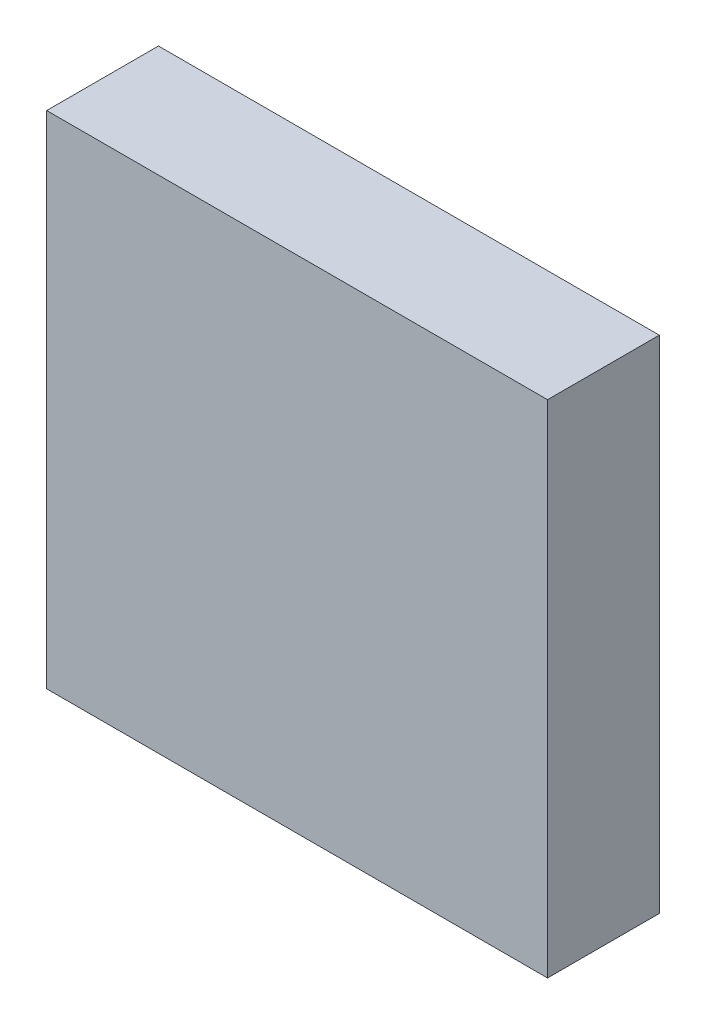
ISO-10303-21;
HEADER;
FILE_DESCRIPTION(('STEP AP214'),'2;1');
FILE_NAME('part.step','',(''),(''),'','','');
FILE_SCHEMA(('AUTOMOTIVE_DESIGN { 1 0 10303 214 1 1 1 1 }'));
ENDSEC;
DATA;
#1=APPLICATION_CONTEXT('core data for automotive mechanical design processes');
#2=APPLICATION_PROTOCOL_DEFINITION('international standard','automotive_design',2000,#1);
#3=PRODUCT_CONTEXT('',#1,'mechanical');
#4=PRODUCT('Part','Part','',(#3));
#5=PRODUCT_RELATED_PRODUCT_CATEGORY('part','',(#4));
#6=PRODUCT_DEFINITION_FORMATION('','',#4);
#7=PRODUCT_DEFINITION_CONTEXT('part definition',#1,'design');
#8=PRODUCT_DEFINITION('design','',#6,#7);
#9=PRODUCT_DEFINITION_SHAPE('','',#8);
#10=(LENGTH_UNIT() NAMED_UNIT(*) SI_UNIT(.MILLI.,.METRE.));
#11=(NAMED_UNIT(*) PLANE_ANGLE_UNIT() SI_UNIT($,.RADIAN.));
#12=(NAMED_UNIT(*) SI_UNIT($,.STERADIAN.) SOLID_ANGLE_UNIT());
#13=UNCERTAINTY_MEASURE_WITH_UNIT(LENGTH_MEASURE(1.E-05),#10,'distance_accuracy_value','');
#14=(GEOMETRIC_REPRESENTATION_CONTEXT(3) GLOBAL_UNCERTAINTY_ASSIGNED_CONTEXT((#13)) GLOBAL_UNIT_ASSIGNED_CONTEXT((#10,
#11,#12)) REPRESENTATION_CONTEXT('',''));
#15=CARTESIAN_POINT('',(0.,0.,0.));
#16=DIRECTION('',(0.,0.,1.));
#17=DIRECTION('',(1.,0.,0.));
#18=AXIS2_PLACEMENT_3D('',#15,#16,#17);
#19=CARTESIAN_POINT('',(-3.58499918,-3.58499918,1.59999934));
#20=DIRECTION('',(0.,0.,1.));
#21=DIRECTION('',(1.,0.,0.));
#22=AXIS2_PLACEMENT_3D('',#19,#20,#21);
#23=PLANE('',#22);
#24=DIRECTION('',(-1.,0.,0.));
#25=VECTOR('',#24,1.);
#26=CARTESIAN_POINT('',(3.58499918,-3.58499918,1.59999934));
#27=LINE('',#26,#25);
#28=CARTESIAN_POINT('',(3.58499918,-3.58499918,1.59999934));
#29=VERTEX_POINT('',#28);
#30=CARTESIAN_POINT('',(-3.58499918,-3.58499918,1.59999934));
#31=VERTEX_POINT('',#30);
#32=EDGE_CURVE('E27',#29,#31,#27,.T.);
#33=ORIENTED_EDGE('',*,*,#32,.F.);
#34=DIRECTION('',(0.,-1.,0.));
#35=VECTOR('',#34,1.);
#36=CARTESIAN_POINT('',(3.58499918,3.58499918,1.59999934));
#37=LINE('',#36,#35);
#38=CARTESIAN_POINT('',(3.58499918,3.58499918,1.59999934));
#39=VERTEX_POINT('',#38);
#40=EDGE_CURVE('E64',#39,#29,#37,.T.);
#41=ORIENTED_EDGE('',*,*,#40,.F.);
#42=DIRECTION('',(1.,0.,0.));
#43=VECTOR('',#42,1.);
#44=CARTESIAN_POINT('',(-3.58499918,3.58499918,1.59999934));
#45=LINE('',#44,#43);
#46=CARTESIAN_POINT('',(-3.58499918,3.58499918,1.59999934));
#47=VERTEX_POINT('',#46);
#48=EDGE_CURVE('E86',#47,#39,#45,.T.);
#49=ORIENTED_EDGE('',*,*,#48,.F.);
#50=DIRECTION('',(0.,1.,0.));
#51=VECTOR('',#50,1.);
#52=CARTESIAN_POINT('',(-3.58499918,-3.58499918,1.59999934));
#53=LINE('',#52,#51);
#54=EDGE_CURVE('E84',#31,#47,#53,.T.);
#55=ORIENTED_EDGE('',*,*,#54,.F.);
#56=EDGE_LOOP('',(#33,#41,#49,#55));
#57=FACE_BOUND('',#56,.T.);
#58=ADVANCED_FACE('F17',(#57),#23,.T.);
#59=CARTESIAN_POINT('',(-3.58499918,-3.58499918,0.));
#60=DIRECTION('',(0.,0.,1.));
#61=DIRECTION('',(1.,0.,0.));
#62=AXIS2_PLACEMENT_3D('',#59,#60,#61);
#63=PLANE('',#62);
#64=DIRECTION('',(0.,1.,0.));
#65=VECTOR('',#64,1.);
#66=CARTESIAN_POINT('',(-3.58499918,-3.58499918,0.));
#67=LINE('',#66,#65);
#68=CARTESIAN_POINT('',(-3.58499918,-3.58499918,0.));
#69=VERTEX_POINT('',#68);
#70=CARTESIAN_POINT('',(-3.58499918,3.58499918,0.));
#71=VERTEX_POINT('',#70);
#72=EDGE_CURVE('E94',#69,#71,#67,.T.);
#73=ORIENTED_EDGE('',*,*,#72,.T.);
#74=DIRECTION('',(1.,0.,0.));
#75=VECTOR('',#74,1.);
#76=CARTESIAN_POINT('',(-3.58499918,3.58499918,0.));
#77=LINE('',#76,#75);
#78=CARTESIAN_POINT('',(3.58499918,3.58499918,0.));
#79=VERTEX_POINT('',#78);
#80=EDGE_CURVE('E112',#71,#79,#77,.T.);
#81=ORIENTED_EDGE('',*,*,#80,.T.);
#82=DIRECTION('',(0.,-1.,0.));
#83=VECTOR('',#82,1.);
#84=CARTESIAN_POINT('',(3.58499918,3.58499918,0.));
#85=LINE('',#84,#83);
#86=CARTESIAN_POINT('',(3.58499918,-3.58499918,0.));
#87=VERTEX_POINT('',#86);
#88=EDGE_CURVE('E52',#79,#87,#85,.T.);
#89=ORIENTED_EDGE('',*,*,#88,.T.);
#90=DIRECTION('',(-1.,0.,0.));
#91=VECTOR('',#90,1.);
#92=CARTESIAN_POINT('',(3.58499918,-3.58499918,0.));
#93=LINE('',#92,#91);
#94=EDGE_CURVE('E11',#87,#69,#93,.T.);
#95=ORIENTED_EDGE('',*,*,#94,.T.);
#96=EDGE_LOOP('',(#73,#81,#89,#95));
#97=FACE_BOUND('',#96,.T.);
#98=ADVANCED_FACE('F171',(#97),#63,.F.);
#99=CARTESIAN_POINT('',(3.58499918,-3.58499918,0.));
#100=DIRECTION('',(0.,-1.,0.));
#101=DIRECTION('',(0.,0.,-1.));
#102=AXIS2_PLACEMENT_3D('',#99,#100,#101);
#103=PLANE('',#102);
#104=DIRECTION('',(0.,0.,1.));
#105=VECTOR('',#104,1.);
#106=CARTESIAN_POINT('',(3.58499918,-3.58499918,0.));
#107=LINE('',#106,#105);
#108=EDGE_CURVE('E20',#87,#29,#107,.T.);
#109=ORIENTED_EDGE('',*,*,#108,.T.);
#110=ORIENTED_EDGE('',*,*,#32,.T.);
#111=DIRECTION('',(0.,0.,1.));
#112=VECTOR('',#111,1.);
#113=CARTESIAN_POINT('',(-3.58499918,-3.58499918,0.));
#114=LINE('',#113,#112);
#115=EDGE_CURVE('E81',#69,#31,#114,.T.);
#116=ORIENTED_EDGE('',*,*,#115,.F.);
#117=ORIENTED_EDGE('',*,*,#94,.F.);
#118=EDGE_LOOP('',(#109,#110,#116,#117));
#119=FACE_BOUND('',#118,.T.);
#120=ADVANCED_FACE('F79',(#119),#103,.T.);
#121=CARTESIAN_POINT('',(3.58499918,3.58499918,0.));
#122=DIRECTION('',(1.,0.,0.));
#123=DIRECTION('',(0.,1.,0.));
#124=AXIS2_PLACEMENT_3D('',#121,#122,#123);
#125=PLANE('',#124);
#126=DIRECTION('',(0.,0.,1.));
#127=VECTOR('',#126,1.);
#128=CARTESIAN_POINT('',(3.58499918,3.58499918,0.));
#129=LINE('',#128,#127);
#130=EDGE_CURVE('E109',#79,#39,#129,.T.);
#131=ORIENTED_EDGE('',*,*,#130,.T.);
#132=ORIENTED_EDGE('',*,*,#40,.T.);
#133=ORIENTED_EDGE('',*,*,#108,.F.);
#134=ORIENTED_EDGE('',*,*,#88,.F.);
#135=EDGE_LOOP('',(#131,#132,#133,#134));
#136=FACE_BOUND('',#135,.T.);
#137=ADVANCED_FACE('F153',(#136),#125,.T.);
#138=CARTESIAN_POINT('',(-3.58499918,3.58499918,0.));
#139=DIRECTION('',(0.,1.,0.));
#140=DIRECTION('',(1.,0.,0.));
#141=AXIS2_PLACEMENT_3D('',#138,#139,#140);
#142=PLANE('',#141);
#143=DIRECTION('',(0.,0.,1.));
#144=VECTOR('',#143,1.);
#145=CARTESIAN_POINT('',(-3.58499918,3.58499918,0.));
#146=LINE('',#145,#144);
#147=EDGE_CURVE('E91',#71,#47,#146,.T.);
#148=ORIENTED_EDGE('',*,*,#147,.T.);
#149=ORIENTED_EDGE('',*,*,#48,.T.);
#150=ORIENTED_EDGE('',*,*,#130,.F.);
#151=ORIENTED_EDGE('',*,*,#80,.F.);
#152=EDGE_LOOP('',(#148,#149,#150,#151));
#153=FACE_BOUND('',#152,.T.);
#154=ADVANCED_FACE('F141',(#153),#142,.T.);
#155=CARTESIAN_POINT('',(-3.58499918,-3.58499918,0.));
#156=DIRECTION('',(-1.,0.,0.));
#157=DIRECTION('',(0.,0.,1.));
#158=AXIS2_PLACEMENT_3D('',#155,#156,#157);
#159=PLANE('',#158);
#160=ORIENTED_EDGE('',*,*,#115,.T.);
#161=ORIENTED_EDGE('',*,*,#54,.T.);
#162=ORIENTED_EDGE('',*,*,#147,.F.);
#163=ORIENTED_EDGE('',*,*,#72,.F.);
#164=EDGE_LOOP('',(#160,#161,#162,#163));
#165=FACE_BOUND('',#164,.T.);
#166=ADVANCED_FACE('F93',(#165),#159,.T.);
#167=CLOSED_SHELL('',(#58,#98,#120,#137,#154,#166));
#168=MANIFOLD_SOLID_BREP('B1',#167);
#169=ADVANCED_BREP_SHAPE_REPRESENTATION('',(#18,#168),#14);
#170=SHAPE_DEFINITION_REPRESENTATION(#9,#169);
ENDSEC;
END-ISO-10303-21;
